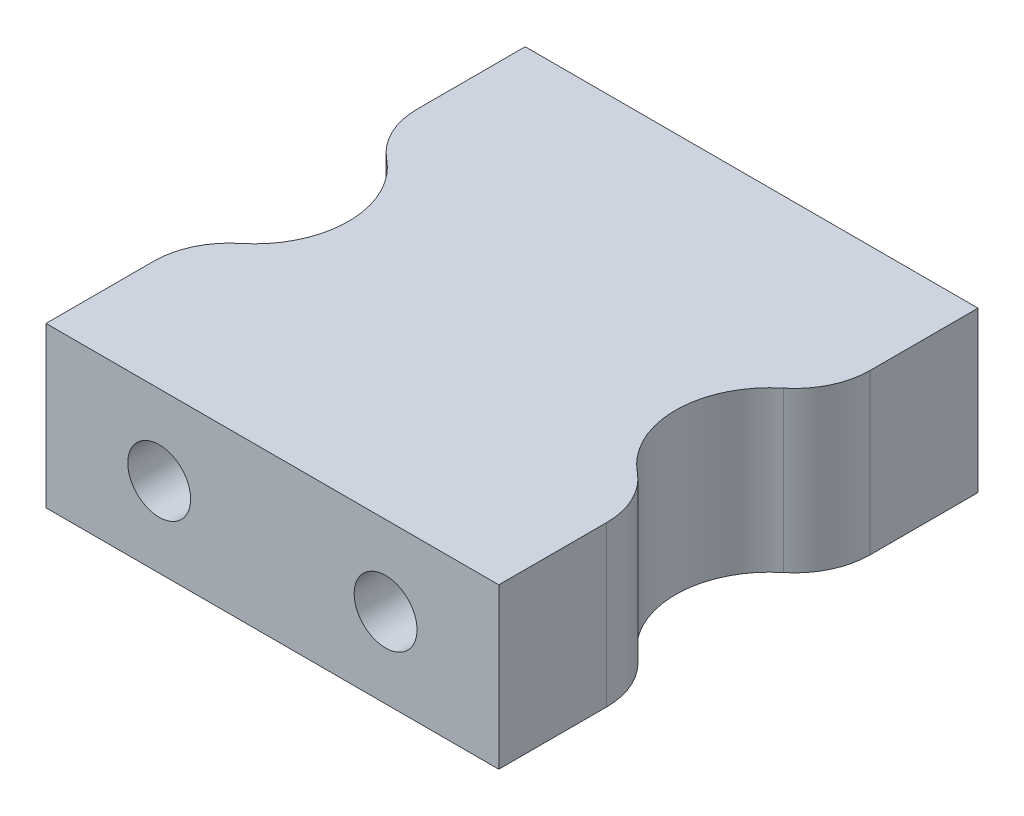
ISO-10303-21;
HEADER;
FILE_DESCRIPTION(('STEP AP214'),'2;1');
FILE_NAME('part.step','',(''),(''),'','','');
FILE_SCHEMA(('AUTOMOTIVE_DESIGN { 1 0 10303 214 1 1 1 1 }'));
ENDSEC;
DATA;
#1=APPLICATION_CONTEXT('core data for automotive mechanical design processes');
#2=APPLICATION_PROTOCOL_DEFINITION('international standard','automotive_design',2000,#1);
#3=PRODUCT_CONTEXT('',#1,'mechanical');
#4=PRODUCT('Part','Part','',(#3));
#5=PRODUCT_RELATED_PRODUCT_CATEGORY('part','',(#4));
#6=PRODUCT_DEFINITION_FORMATION('','',#4);
#7=PRODUCT_DEFINITION_CONTEXT('part definition',#1,'design');
#8=PRODUCT_DEFINITION('design','',#6,#7);
#9=PRODUCT_DEFINITION_SHAPE('','',#8);
#10=(LENGTH_UNIT() NAMED_UNIT(*) SI_UNIT(.MILLI.,.METRE.));
#11=(NAMED_UNIT(*) PLANE_ANGLE_UNIT() SI_UNIT($,.RADIAN.));
#12=(NAMED_UNIT(*) SI_UNIT($,.STERADIAN.) SOLID_ANGLE_UNIT());
#13=UNCERTAINTY_MEASURE_WITH_UNIT(LENGTH_MEASURE(1.E-05),#10,'distance_accuracy_value','');
#14=(GEOMETRIC_REPRESENTATION_CONTEXT(3) GLOBAL_UNCERTAINTY_ASSIGNED_CONTEXT((#13)) GLOBAL_UNIT_ASSIGNED_CONTEXT((#10,
#11,#12)) REPRESENTATION_CONTEXT('',''));
#15=CARTESIAN_POINT('',(0.,0.,0.));
#16=DIRECTION('',(0.,0.,1.));
#17=DIRECTION('',(1.,0.,0.));
#18=AXIS2_PLACEMENT_3D('',#15,#16,#17);
#19=CARTESIAN_POINT('',(0.,0.,19.05));
#20=DIRECTION('',(1.,0.,0.));
#21=DIRECTION('',(0.,1.,0.));
#22=AXIS2_PLACEMENT_3D('',#19,#20,#21);
#23=PLANE('',#22);
#24=DIRECTION('',(0.,0.,-1.));
#25=VECTOR('',#24,1.);
#26=CARTESIAN_POINT('',(0.,0.,19.05));
#27=LINE('',#26,#25);
#28=CARTESIAN_POINT('',(0.,0.,4.28805193839007));
#29=VERTEX_POINT('',#28);
#30=CARTESIAN_POINT('',(0.,0.,0.));
#31=VERTEX_POINT('',#30);
#32=EDGE_CURVE('E161',#29,#31,#27,.T.);
#33=ORIENTED_EDGE('',*,*,#32,.F.);
#34=DIRECTION('',(0.,1.,0.));
#35=VECTOR('',#34,1.);
#36=CARTESIAN_POINT('',(0.,0.,4.28805193839007));
#37=LINE('',#36,#35);
#38=CARTESIAN_POINT('',(0.,6.35,4.28805193839007));
#39=VERTEX_POINT('',#38);
#40=EDGE_CURVE('E11',#29,#39,#37,.T.);
#41=ORIENTED_EDGE('',*,*,#40,.T.);
#42=DIRECTION('',(0.,0.,-1.));
#43=VECTOR('',#42,1.);
#44=CARTESIAN_POINT('',(0.,6.35,19.05));
#45=LINE('',#44,#43);
#46=CARTESIAN_POINT('',(0.,6.35,0.));
#47=VERTEX_POINT('',#46);
#48=EDGE_CURVE('E214',#39,#47,#45,.T.);
#49=ORIENTED_EDGE('',*,*,#48,.T.);
#50=DIRECTION('',(0.,-1.,0.));
#51=VECTOR('',#50,1.);
#52=CARTESIAN_POINT('',(0.,0.,0.));
#53=LINE('',#52,#51);
#54=EDGE_CURVE('E215',#47,#31,#53,.T.);
#55=ORIENTED_EDGE('',*,*,#54,.T.);
#56=EDGE_LOOP('',(#33,#41,#49,#55));
#57=FACE_BOUND('',#56,.T.);
#58=ADVANCED_FACE('F45',(#57),#23,.F.);
#59=CARTESIAN_POINT('',(18.,0.,19.05));
#60=DIRECTION('',(-1.,0.,0.));
#61=DIRECTION('',(0.,0.,1.));
#62=AXIS2_PLACEMENT_3D('',#59,#60,#61);
#63=PLANE('',#62);
#64=DIRECTION('',(0.,0.,-1.));
#65=VECTOR('',#64,1.);
#66=CARTESIAN_POINT('',(18.,0.,19.05));
#67=LINE('',#66,#65);
#68=CARTESIAN_POINT('',(18.,0.,19.05));
#69=VERTEX_POINT('',#68);
#70=CARTESIAN_POINT('',(18.,0.,14.7619480616099));
#71=VERTEX_POINT('',#70);
#72=EDGE_CURVE('E143',#69,#71,#67,.T.);
#73=ORIENTED_EDGE('',*,*,#72,.T.);
#74=DIRECTION('',(0.,1.,0.));
#75=VECTOR('',#74,1.);
#76=CARTESIAN_POINT('',(18.,0.,14.7619480616099));
#77=LINE('',#76,#75);
#78=CARTESIAN_POINT('',(18.,6.35,14.7619480616099));
#79=VERTEX_POINT('',#78);
#80=EDGE_CURVE('E160',#71,#79,#77,.T.);
#81=ORIENTED_EDGE('',*,*,#80,.T.);
#82=DIRECTION('',(0.,0.,-1.));
#83=VECTOR('',#82,1.);
#84=CARTESIAN_POINT('',(18.,6.35,19.05));
#85=LINE('',#84,#83);
#86=CARTESIAN_POINT('',(18.,6.35,19.05));
#87=VERTEX_POINT('',#86);
#88=EDGE_CURVE('E228',#87,#79,#85,.T.);
#89=ORIENTED_EDGE('',*,*,#88,.F.);
#90=DIRECTION('',(0.,1.,0.));
#91=VECTOR('',#90,1.);
#92=CARTESIAN_POINT('',(18.,0.,19.05));
#93=LINE('',#92,#91);
#94=EDGE_CURVE('E146',#69,#87,#93,.T.);
#95=ORIENTED_EDGE('',*,*,#94,.F.);
#96=EDGE_LOOP('',(#73,#81,#89,#95));
#97=FACE_BOUND('',#96,.T.);
#98=ADVANCED_FACE('F253',(#97),#63,.F.);
#99=CARTESIAN_POINT('',(0.,6.35,19.05));
#100=VERTEX_POINT('',#99);
#101=CARTESIAN_POINT('',(0.,6.35,14.7619480616099));
#102=VERTEX_POINT('',#101);
#103=EDGE_CURVE('E226',#100,#102,#45,.T.);
#104=ORIENTED_EDGE('',*,*,#103,.T.);
#105=DIRECTION('',(0.,1.,0.));
#106=VECTOR('',#105,1.);
#107=CARTESIAN_POINT('',(0.,0.,14.7619480616099));
#108=LINE('',#107,#106);
#109=CARTESIAN_POINT('',(0.,0.,14.7619480616099));
#110=VERTEX_POINT('',#109);
#111=EDGE_CURVE('E53',#102,#110,#108,.F.);
#112=ORIENTED_EDGE('',*,*,#111,.T.);
#113=CARTESIAN_POINT('',(0.,0.,19.05));
#114=VERTEX_POINT('',#113);
#115=EDGE_CURVE('E140',#114,#110,#27,.T.);
#116=ORIENTED_EDGE('',*,*,#115,.F.);
#117=DIRECTION('',(0.,-1.,0.));
#118=VECTOR('',#117,1.);
#119=CARTESIAN_POINT('',(0.,0.,19.05));
#120=LINE('',#119,#118);
#121=EDGE_CURVE('E147',#100,#114,#120,.T.);
#122=ORIENTED_EDGE('',*,*,#121,.F.);
#123=EDGE_LOOP('',(#104,#112,#116,#122));
#124=FACE_BOUND('',#123,.T.);
#125=ADVANCED_FACE('F158',(#124),#23,.F.);
#126=CARTESIAN_POINT('',(0.,0.,19.05));
#127=DIRECTION('',(0.,1.,0.));
#128=DIRECTION('',(0.,0.,1.));
#129=AXIS2_PLACEMENT_3D('',#126,#127,#128);
#130=PLANE('',#129);
#131=CARTESIAN_POINT('',(19.235125,0.,9.525));
#132=DIRECTION('',(0.,1.,0.));
#133=DIRECTION('',(1.,0.,0.));
#134=AXIS2_PLACEMENT_3D('',#131,#132,#133);
#135=CIRCLE('',#134,3.735125);
#136=CARTESIAN_POINT('',(16.8864349214009,0.,6.62072493032857));
#137=VERTEX_POINT('',#136);
#138=CARTESIAN_POINT('',(16.8864349214009,0.,12.4292750696714));
#139=VERTEX_POINT('',#138);
#140=EDGE_CURVE('E206',#137,#139,#135,.T.);
#141=ORIENTED_EDGE('',*,*,#140,.T.);
#142=CARTESIAN_POINT('',(15.,0.,14.7619480616099));
#143=DIRECTION('',(0.,1.,0.));
#144=DIRECTION('',(0.,0.,1.));
#145=AXIS2_PLACEMENT_3D('',#142,#143,#144);
#146=CIRCLE('',#145,3.);
#147=EDGE_CURVE('E186',#139,#71,#146,.F.);
#148=ORIENTED_EDGE('',*,*,#147,.T.);
#149=ORIENTED_EDGE('',*,*,#72,.F.);
#150=DIRECTION('',(1.,0.,0.));
#151=VECTOR('',#150,1.);
#152=CARTESIAN_POINT('',(0.,0.,19.05));
#153=LINE('',#152,#151);
#154=EDGE_CURVE('E135',#114,#69,#153,.T.);
#155=ORIENTED_EDGE('',*,*,#154,.F.);
#156=ORIENTED_EDGE('',*,*,#115,.T.);
#157=CARTESIAN_POINT('',(3.,0.,14.7619480616099));
#158=DIRECTION('',(0.,1.,0.));
#159=DIRECTION('',(0.,0.,1.));
#160=AXIS2_PLACEMENT_3D('',#157,#158,#159);
#161=CIRCLE('',#160,3.);
#162=CARTESIAN_POINT('',(1.11356507859914,0.,12.4292750696714));
#163=VERTEX_POINT('',#162);
#164=EDGE_CURVE('E182',#110,#163,#161,.F.);
#165=ORIENTED_EDGE('',*,*,#164,.T.);
#166=CARTESIAN_POINT('',(-1.235125,0.,9.525));
#167=DIRECTION('',(0.,1.,0.));
#168=DIRECTION('',(-1.,0.,0.));
#169=AXIS2_PLACEMENT_3D('',#166,#167,#168);
#170=CIRCLE('',#169,3.735125);
#171=CARTESIAN_POINT('',(1.11356507859914,0.,6.62072493032857));
#172=VERTEX_POINT('',#171);
#173=EDGE_CURVE('E197',#163,#172,#170,.T.);
#174=ORIENTED_EDGE('',*,*,#173,.T.);
#175=CARTESIAN_POINT('',(3.,0.,4.28805193839007));
#176=DIRECTION('',(0.,1.,0.));
#177=DIRECTION('',(0.,0.,1.));
#178=AXIS2_PLACEMENT_3D('',#175,#176,#177);
#179=CIRCLE('',#178,3.);
#180=EDGE_CURVE('E60',#172,#29,#179,.F.);
#181=ORIENTED_EDGE('',*,*,#180,.T.);
#182=ORIENTED_EDGE('',*,*,#32,.T.);
#183=DIRECTION('',(1.,0.,0.));
#184=VECTOR('',#183,1.);
#185=CARTESIAN_POINT('',(0.,0.,0.));
#186=LINE('',#185,#184);
#187=CARTESIAN_POINT('',(18.,0.,0.));
#188=VERTEX_POINT('',#187);
#189=EDGE_CURVE('E218',#31,#188,#186,.T.);
#190=ORIENTED_EDGE('',*,*,#189,.T.);
#191=CARTESIAN_POINT('',(18.,0.,4.28805193839007));
#192=VERTEX_POINT('',#191);
#193=EDGE_CURVE('E229',#192,#188,#67,.T.);
#194=ORIENTED_EDGE('',*,*,#193,.F.);
#195=CARTESIAN_POINT('',(15.,0.,4.28805193839007));
#196=DIRECTION('',(0.,1.,0.));
#197=DIRECTION('',(0.,0.,1.));
#198=AXIS2_PLACEMENT_3D('',#195,#196,#197);
#199=CIRCLE('',#198,3.);
#200=EDGE_CURVE('E184',#192,#137,#199,.F.);
#201=ORIENTED_EDGE('',*,*,#200,.T.);
#202=EDGE_LOOP('',(#141,#148,#149,#155,#156,#165,#174,#181,#182,#190,#194,#201));
#203=FACE_BOUND('',#202,.T.);
#204=ADVANCED_FACE('F138',(#203),#130,.F.);
#205=CARTESIAN_POINT('',(18.,6.35,4.28805193839007));
#206=VERTEX_POINT('',#205);
#207=CARTESIAN_POINT('',(18.,6.35,0.));
#208=VERTEX_POINT('',#207);
#209=EDGE_CURVE('E227',#206,#208,#85,.T.);
#210=ORIENTED_EDGE('',*,*,#209,.F.);
#211=DIRECTION('',(0.,1.,0.));
#212=VECTOR('',#211,1.);
#213=CARTESIAN_POINT('',(18.,0.,4.28805193839007));
#214=LINE('',#213,#212);
#215=EDGE_CURVE('E188',#206,#192,#214,.F.);
#216=ORIENTED_EDGE('',*,*,#215,.T.);
#217=ORIENTED_EDGE('',*,*,#193,.T.);
#218=DIRECTION('',(0.,1.,0.));
#219=VECTOR('',#218,1.);
#220=CARTESIAN_POINT('',(18.,0.,0.));
#221=LINE('',#220,#219);
#222=EDGE_CURVE('E221',#188,#208,#221,.T.);
#223=ORIENTED_EDGE('',*,*,#222,.T.);
#224=EDGE_LOOP('',(#210,#216,#217,#223));
#225=FACE_BOUND('',#224,.T.);
#226=ADVANCED_FACE('F238',(#225),#63,.F.);
#227=CARTESIAN_POINT('',(0.,6.35,19.05));
#228=DIRECTION('',(0.,-1.,0.));
#229=DIRECTION('',(0.,0.,-1.));
#230=AXIS2_PLACEMENT_3D('',#227,#228,#229);
#231=PLANE('',#230);
#232=ORIENTED_EDGE('',*,*,#88,.T.);
#233=CARTESIAN_POINT('',(15.,6.35,14.7619480616099));
#234=DIRECTION('',(0.,-1.,0.));
#235=DIRECTION('',(0.,0.,-1.));
#236=AXIS2_PLACEMENT_3D('',#233,#234,#235);
#237=CIRCLE('',#236,3.);
#238=CARTESIAN_POINT('',(16.8864349214009,6.35,12.4292750696714));
#239=VERTEX_POINT('',#238);
#240=EDGE_CURVE('E174',#79,#239,#237,.F.);
#241=ORIENTED_EDGE('',*,*,#240,.T.);
#242=CARTESIAN_POINT('',(19.235125,6.35,9.525));
#243=DIRECTION('',(0.,1.,0.));
#244=DIRECTION('',(1.,0.,0.));
#245=AXIS2_PLACEMENT_3D('',#242,#243,#244);
#246=CIRCLE('',#245,3.735125);
#247=CARTESIAN_POINT('',(16.8864349214009,6.35,6.62072493032857));
#248=VERTEX_POINT('',#247);
#249=EDGE_CURVE('E203',#248,#239,#246,.T.);
#250=ORIENTED_EDGE('',*,*,#249,.F.);
#251=CARTESIAN_POINT('',(15.,6.35,4.28805193839007));
#252=DIRECTION('',(0.,-1.,0.));
#253=DIRECTION('',(0.,0.,-1.));
#254=AXIS2_PLACEMENT_3D('',#251,#252,#253);
#255=CIRCLE('',#254,3.);
#256=EDGE_CURVE('E172',#248,#206,#255,.F.);
#257=ORIENTED_EDGE('',*,*,#256,.T.);
#258=ORIENTED_EDGE('',*,*,#209,.T.);
#259=DIRECTION('',(-1.,0.,0.));
#260=VECTOR('',#259,1.);
#261=CARTESIAN_POINT('',(0.,6.35,0.));
#262=LINE('',#261,#260);
#263=EDGE_CURVE('E156',#208,#47,#262,.T.);
#264=ORIENTED_EDGE('',*,*,#263,.T.);
#265=ORIENTED_EDGE('',*,*,#48,.F.);
#266=CARTESIAN_POINT('',(3.,6.35,4.28805193839007));
#267=DIRECTION('',(0.,-1.,0.));
#268=DIRECTION('',(0.,0.,-1.));
#269=AXIS2_PLACEMENT_3D('',#266,#267,#268);
#270=CIRCLE('',#269,3.);
#271=CARTESIAN_POINT('',(1.11356507859914,6.35,6.62072493032857));
#272=VERTEX_POINT('',#271);
#273=EDGE_CURVE('E164',#39,#272,#270,.F.);
#274=ORIENTED_EDGE('',*,*,#273,.T.);
#275=CARTESIAN_POINT('',(-1.235125,6.35,9.525));
#276=DIRECTION('',(0.,1.,0.));
#277=DIRECTION('',(-1.,0.,0.));
#278=AXIS2_PLACEMENT_3D('',#275,#276,#277);
#279=CIRCLE('',#278,3.735125);
#280=CARTESIAN_POINT('',(1.11356507859914,6.35,12.4292750696714));
#281=VERTEX_POINT('',#280);
#282=EDGE_CURVE('E196',#281,#272,#279,.T.);
#283=ORIENTED_EDGE('',*,*,#282,.F.);
#284=CARTESIAN_POINT('',(3.,6.35,14.7619480616099));
#285=DIRECTION('',(0.,-1.,0.));
#286=DIRECTION('',(0.,0.,-1.));
#287=AXIS2_PLACEMENT_3D('',#284,#285,#286);
#288=CIRCLE('',#287,3.);
#289=EDGE_CURVE('E170',#281,#102,#288,.F.);
#290=ORIENTED_EDGE('',*,*,#289,.T.);
#291=ORIENTED_EDGE('',*,*,#103,.F.);
#292=DIRECTION('',(-1.,0.,0.));
#293=VECTOR('',#292,1.);
#294=CARTESIAN_POINT('',(0.,6.35,19.05));
#295=LINE('',#294,#293);
#296=EDGE_CURVE('E152',#87,#100,#295,.T.);
#297=ORIENTED_EDGE('',*,*,#296,.F.);
#298=EDGE_LOOP('',(#232,#241,#250,#257,#258,#264,#265,#274,#283,#290,#291,#297));
#299=FACE_BOUND('',#298,.T.);
#300=ADVANCED_FACE('F201',(#299),#231,.F.);
#301=CARTESIAN_POINT('',(0.,0.,19.05));
#302=DIRECTION('',(0.,0.,-1.));
#303=DIRECTION('',(-1.,0.,0.));
#304=AXIS2_PLACEMENT_3D('',#301,#302,#303);
#305=PLANE('',#304);
#306=CARTESIAN_POINT('',(13.5,3.175,19.05));
#307=DIRECTION('',(0.,0.,-1.));
#308=DIRECTION('',(-1.,0.,0.));
#309=AXIS2_PLACEMENT_3D('',#306,#307,#308);
#310=CIRCLE('',#309,1.25);
#311=CARTESIAN_POINT('',(12.25,3.175,19.05));
#312=VERTEX_POINT('',#311);
#313=EDGE_CURVE('E325',#312,#312,#310,.T.);
#314=ORIENTED_EDGE('',*,*,#313,.T.);
#315=EDGE_LOOP('',(#314));
#316=FACE_BOUND('',#315,.T.);
#317=CARTESIAN_POINT('',(4.5,3.175,19.05));
#318=DIRECTION('',(0.,0.,-1.));
#319=DIRECTION('',(-1.,0.,0.));
#320=AXIS2_PLACEMENT_3D('',#317,#318,#319);
#321=CIRCLE('',#320,1.25);
#322=CARTESIAN_POINT('',(3.25,3.175,19.05));
#323=VERTEX_POINT('',#322);
#324=EDGE_CURVE('E336',#323,#323,#321,.T.);
#325=ORIENTED_EDGE('',*,*,#324,.T.);
#326=EDGE_LOOP('',(#325));
#327=FACE_BOUND('',#326,.T.);
#328=ORIENTED_EDGE('',*,*,#121,.T.);
#329=ORIENTED_EDGE('',*,*,#154,.T.);
#330=ORIENTED_EDGE('',*,*,#94,.T.);
#331=ORIENTED_EDGE('',*,*,#296,.T.);
#332=EDGE_LOOP('',(#328,#329,#330,#331));
#333=FACE_BOUND('',#332,.T.);
#334=ADVANCED_FACE('F150',(#316,#327,#333),#305,.F.);
#335=CARTESIAN_POINT('',(0.,0.,0.));
#336=DIRECTION('',(0.,0.,-1.));
#337=DIRECTION('',(-1.,0.,0.));
#338=AXIS2_PLACEMENT_3D('',#335,#336,#337);
#339=PLANE('',#338);
#340=CARTESIAN_POINT('',(13.5,3.175,0.));
#341=DIRECTION('',(0.,0.,-1.));
#342=DIRECTION('',(-1.,0.,0.));
#343=AXIS2_PLACEMENT_3D('',#340,#341,#342);
#344=CIRCLE('',#343,1.25);
#345=CARTESIAN_POINT('',(12.25,3.175,0.));
#346=VERTEX_POINT('',#345);
#347=EDGE_CURVE('E341',#346,#346,#344,.T.);
#348=ORIENTED_EDGE('',*,*,#347,.F.);
#349=EDGE_LOOP('',(#348));
#350=FACE_BOUND('',#349,.T.);
#351=CARTESIAN_POINT('',(4.5,3.175,0.));
#352=DIRECTION('',(0.,0.,-1.));
#353=DIRECTION('',(-1.,0.,0.));
#354=AXIS2_PLACEMENT_3D('',#351,#352,#353);
#355=CIRCLE('',#354,1.25);
#356=CARTESIAN_POINT('',(3.25,3.175,0.));
#357=VERTEX_POINT('',#356);
#358=EDGE_CURVE('E328',#357,#357,#355,.T.);
#359=ORIENTED_EDGE('',*,*,#358,.F.);
#360=EDGE_LOOP('',(#359));
#361=FACE_BOUND('',#360,.T.);
#362=ORIENTED_EDGE('',*,*,#54,.F.);
#363=ORIENTED_EDGE('',*,*,#263,.F.);
#364=ORIENTED_EDGE('',*,*,#222,.F.);
#365=ORIENTED_EDGE('',*,*,#189,.F.);
#366=EDGE_LOOP('',(#362,#363,#364,#365));
#367=FACE_BOUND('',#366,.T.);
#368=ADVANCED_FACE('F242',(#350,#361,#367),#339,.T.);
#369=CARTESIAN_POINT('',(-1.235125,0.,9.525));
#370=DIRECTION('',(0.,1.,0.));
#371=DIRECTION('',(-1.,0.,0.));
#372=AXIS2_PLACEMENT_3D('',#369,#370,#371);
#373=CYLINDRICAL_SURFACE('',#372,3.735125);
#374=ORIENTED_EDGE('',*,*,#173,.F.);
#375=DIRECTION('',(0.,1.,0.));
#376=VECTOR('',#375,1.);
#377=CARTESIAN_POINT('',(1.11356507859914,0.,12.4292750696714));
#378=LINE('',#377,#376);
#379=EDGE_CURVE('E191',#163,#281,#378,.T.);
#380=ORIENTED_EDGE('',*,*,#379,.T.);
#381=ORIENTED_EDGE('',*,*,#282,.T.);
#382=DIRECTION('',(0.,1.,0.));
#383=VECTOR('',#382,1.);
#384=CARTESIAN_POINT('',(1.11356507859914,0.,6.62072493032857));
#385=LINE('',#384,#383);
#386=EDGE_CURVE('E68',#272,#172,#385,.F.);
#387=ORIENTED_EDGE('',*,*,#386,.T.);
#388=EDGE_LOOP('',(#374,#380,#381,#387));
#389=FACE_BOUND('',#388,.T.);
#390=ADVANCED_FACE('F195',(#389),#373,.F.);
#391=CARTESIAN_POINT('',(19.235125,0.,9.525));
#392=DIRECTION('',(0.,1.,0.));
#393=DIRECTION('',(-1.,0.,0.));
#394=AXIS2_PLACEMENT_3D('',#391,#392,#393);
#395=CYLINDRICAL_SURFACE('',#394,3.735125);
#396=ORIENTED_EDGE('',*,*,#249,.T.);
#397=DIRECTION('',(0.,1.,0.));
#398=VECTOR('',#397,1.);
#399=CARTESIAN_POINT('',(16.8864349214009,0.,12.4292750696714));
#400=LINE('',#399,#398);
#401=EDGE_CURVE('E179',#239,#139,#400,.F.);
#402=ORIENTED_EDGE('',*,*,#401,.T.);
#403=ORIENTED_EDGE('',*,*,#140,.F.);
#404=DIRECTION('',(0.,1.,0.));
#405=VECTOR('',#404,1.);
#406=CARTESIAN_POINT('',(16.8864349214009,0.,6.62072493032857));
#407=LINE('',#406,#405);
#408=EDGE_CURVE('E176',#137,#248,#407,.T.);
#409=ORIENTED_EDGE('',*,*,#408,.T.);
#410=EDGE_LOOP('',(#396,#402,#403,#409));
#411=FACE_BOUND('',#410,.T.);
#412=ADVANCED_FACE('F281',(#411),#395,.F.);
#413=CARTESIAN_POINT('',(4.5,3.175,5.));
#414=DIRECTION('',(0.,0.,-1.));
#415=DIRECTION('',(-1.,0.,0.));
#416=AXIS2_PLACEMENT_3D('',#413,#414,#415);
#417=CYLINDRICAL_SURFACE('',#416,1.25);
#418=CARTESIAN_POINT('',(4.5,3.175,5.));
#419=DIRECTION('',(0.,0.,-1.));
#420=DIRECTION('',(-1.,0.,0.));
#421=AXIS2_PLACEMENT_3D('',#418,#419,#420);
#422=CIRCLE('',#421,1.25);
#423=CARTESIAN_POINT('',(3.25,3.175,5.));
#424=VERTEX_POINT('',#423);
#425=EDGE_CURVE('E324',#424,#424,#422,.T.);
#426=ORIENTED_EDGE('',*,*,#425,.F.);
#427=EDGE_LOOP('',(#426));
#428=FACE_BOUND('',#427,.T.);
#429=ORIENTED_EDGE('',*,*,#358,.T.);
#430=EDGE_LOOP('',(#429));
#431=FACE_BOUND('',#430,.T.);
#432=ADVANCED_FACE('F284',(#428,#431),#417,.F.);
#433=CARTESIAN_POINT('',(4.5,3.175,5.));
#434=DIRECTION('',(0.,0.,-1.));
#435=DIRECTION('',(-1.,0.,0.));
#436=AXIS2_PLACEMENT_3D('',#433,#434,#435);
#437=PLANE('',#436);
#438=ORIENTED_EDGE('',*,*,#425,.T.);
#439=EDGE_LOOP('',(#438));
#440=FACE_BOUND('',#439,.T.);
#441=ADVANCED_FACE('F286',(#440),#437,.T.);
#442=CARTESIAN_POINT('',(13.5,3.175,5.));
#443=DIRECTION('',(0.,0.,-1.));
#444=DIRECTION('',(-1.,0.,0.));
#445=AXIS2_PLACEMENT_3D('',#442,#443,#444);
#446=CYLINDRICAL_SURFACE('',#445,1.25);
#447=CARTESIAN_POINT('',(13.5,3.175,5.));
#448=DIRECTION('',(0.,0.,-1.));
#449=DIRECTION('',(-1.,0.,0.));
#450=AXIS2_PLACEMENT_3D('',#447,#448,#449);
#451=CIRCLE('',#450,1.25);
#452=CARTESIAN_POINT('',(12.25,3.175,5.));
#453=VERTEX_POINT('',#452);
#454=EDGE_CURVE('E208',#453,#453,#451,.T.);
#455=ORIENTED_EDGE('',*,*,#454,.F.);
#456=EDGE_LOOP('',(#455));
#457=FACE_BOUND('',#456,.T.);
#458=ORIENTED_EDGE('',*,*,#347,.T.);
#459=EDGE_LOOP('',(#458));
#460=FACE_BOUND('',#459,.T.);
#461=ADVANCED_FACE('F289',(#457,#460),#446,.F.);
#462=CARTESIAN_POINT('',(13.5,3.175,5.));
#463=DIRECTION('',(0.,0.,-1.));
#464=DIRECTION('',(-1.,0.,0.));
#465=AXIS2_PLACEMENT_3D('',#462,#463,#464);
#466=PLANE('',#465);
#467=ORIENTED_EDGE('',*,*,#454,.T.);
#468=EDGE_LOOP('',(#467));
#469=FACE_BOUND('',#468,.T.);
#470=ADVANCED_FACE('F296',(#469),#466,.T.);
#471=CARTESIAN_POINT('',(4.5,3.175,14.05));
#472=DIRECTION('',(0.,0.,1.));
#473=DIRECTION('',(1.,0.,0.));
#474=AXIS2_PLACEMENT_3D('',#471,#472,#473);
#475=CYLINDRICAL_SURFACE('',#474,1.25);
#476=CARTESIAN_POINT('',(4.5,3.175,14.05));
#477=DIRECTION('',(0.,0.,-1.));
#478=DIRECTION('',(-1.,0.,0.));
#479=AXIS2_PLACEMENT_3D('',#476,#477,#478);
#480=CIRCLE('',#479,1.25);
#481=CARTESIAN_POINT('',(3.25,3.175,14.05));
#482=VERTEX_POINT('',#481);
#483=EDGE_CURVE('E331',#482,#482,#480,.T.);
#484=ORIENTED_EDGE('',*,*,#483,.T.);
#485=EDGE_LOOP('',(#484));
#486=FACE_BOUND('',#485,.T.);
#487=ORIENTED_EDGE('',*,*,#324,.F.);
#488=EDGE_LOOP('',(#487));
#489=FACE_BOUND('',#488,.T.);
#490=ADVANCED_FACE('F300',(#486,#489),#475,.F.);
#491=CARTESIAN_POINT('',(4.5,3.175,14.05));
#492=DIRECTION('',(0.,0.,1.));
#493=DIRECTION('',(-1.,0.,0.));
#494=AXIS2_PLACEMENT_3D('',#491,#492,#493);
#495=PLANE('',#494);
#496=ORIENTED_EDGE('',*,*,#483,.F.);
#497=EDGE_LOOP('',(#496));
#498=FACE_BOUND('',#497,.T.);
#499=ADVANCED_FACE('F304',(#498),#495,.T.);
#500=CARTESIAN_POINT('',(13.5,3.175,14.05));
#501=DIRECTION('',(0.,0.,1.));
#502=DIRECTION('',(1.,0.,0.));
#503=AXIS2_PLACEMENT_3D('',#500,#501,#502);
#504=CYLINDRICAL_SURFACE('',#503,1.25);
#505=CARTESIAN_POINT('',(13.5,3.175,14.05));
#506=DIRECTION('',(0.,0.,-1.));
#507=DIRECTION('',(-1.,0.,0.));
#508=AXIS2_PLACEMENT_3D('',#505,#506,#507);
#509=CIRCLE('',#508,1.25);
#510=CARTESIAN_POINT('',(12.25,3.175,14.05));
#511=VERTEX_POINT('',#510);
#512=EDGE_CURVE('E323',#511,#511,#509,.T.);
#513=ORIENTED_EDGE('',*,*,#512,.T.);
#514=EDGE_LOOP('',(#513));
#515=FACE_BOUND('',#514,.T.);
#516=ORIENTED_EDGE('',*,*,#313,.F.);
#517=EDGE_LOOP('',(#516));
#518=FACE_BOUND('',#517,.T.);
#519=ADVANCED_FACE('F308',(#515,#518),#504,.F.);
#520=CARTESIAN_POINT('',(13.5,3.175,14.05));
#521=DIRECTION('',(0.,0.,1.));
#522=DIRECTION('',(-1.,0.,0.));
#523=AXIS2_PLACEMENT_3D('',#520,#521,#522);
#524=PLANE('',#523);
#525=ORIENTED_EDGE('',*,*,#512,.F.);
#526=EDGE_LOOP('',(#525));
#527=FACE_BOUND('',#526,.T.);
#528=ADVANCED_FACE('F312',(#527),#524,.T.);
#529=CARTESIAN_POINT('',(15.,0.,14.7619480616099));
#530=DIRECTION('',(0.,1.,0.));
#531=DIRECTION('',(-1.,0.,0.));
#532=AXIS2_PLACEMENT_3D('',#529,#530,#531);
#533=CYLINDRICAL_SURFACE('',#532,3.);
#534=ORIENTED_EDGE('',*,*,#147,.F.);
#535=ORIENTED_EDGE('',*,*,#401,.F.);
#536=ORIENTED_EDGE('',*,*,#240,.F.);
#537=ORIENTED_EDGE('',*,*,#80,.F.);
#538=EDGE_LOOP('',(#534,#535,#536,#537));
#539=FACE_BOUND('',#538,.T.);
#540=ADVANCED_FACE('F315',(#539),#533,.T.);
#541=CARTESIAN_POINT('',(15.,0.,4.28805193839007));
#542=DIRECTION('',(0.,1.,0.));
#543=DIRECTION('',(-1.,0.,0.));
#544=AXIS2_PLACEMENT_3D('',#541,#542,#543);
#545=CYLINDRICAL_SURFACE('',#544,3.);
#546=ORIENTED_EDGE('',*,*,#200,.F.);
#547=ORIENTED_EDGE('',*,*,#215,.F.);
#548=ORIENTED_EDGE('',*,*,#256,.F.);
#549=ORIENTED_EDGE('',*,*,#408,.F.);
#550=EDGE_LOOP('',(#546,#547,#548,#549));
#551=FACE_BOUND('',#550,.T.);
#552=ADVANCED_FACE('F251',(#551),#545,.T.);
#553=CARTESIAN_POINT('',(3.,0.,14.7619480616099));
#554=DIRECTION('',(0.,1.,0.));
#555=DIRECTION('',(-1.,0.,0.));
#556=AXIS2_PLACEMENT_3D('',#553,#554,#555);
#557=CYLINDRICAL_SURFACE('',#556,3.);
#558=ORIENTED_EDGE('',*,*,#164,.F.);
#559=ORIENTED_EDGE('',*,*,#111,.F.);
#560=ORIENTED_EDGE('',*,*,#289,.F.);
#561=ORIENTED_EDGE('',*,*,#379,.F.);
#562=EDGE_LOOP('',(#558,#559,#560,#561));
#563=FACE_BOUND('',#562,.T.);
#564=ADVANCED_FACE('F247',(#563),#557,.T.);
#565=CARTESIAN_POINT('',(3.,0.,4.28805193839007));
#566=DIRECTION('',(0.,1.,0.));
#567=DIRECTION('',(-1.,0.,0.));
#568=AXIS2_PLACEMENT_3D('',#565,#566,#567);
#569=CYLINDRICAL_SURFACE('',#568,3.);
#570=ORIENTED_EDGE('',*,*,#180,.F.);
#571=ORIENTED_EDGE('',*,*,#386,.F.);
#572=ORIENTED_EDGE('',*,*,#273,.F.);
#573=ORIENTED_EDGE('',*,*,#40,.F.);
#574=EDGE_LOOP('',(#570,#571,#572,#573));
#575=FACE_BOUND('',#574,.T.);
#576=ADVANCED_FACE('F47',(#575),#569,.T.);
#577=CLOSED_SHELL('',(#58,#98,#125,#204,#226,#300,#334,#368,#390,#412,#432,#441,#461,#470,#490,
#499,#519,#528,#540,#552,#564,#576));
#578=MANIFOLD_SOLID_BREP('B2',#577);
#579=ADVANCED_BREP_SHAPE_REPRESENTATION('',(#18,#578),#14);
#580=SHAPE_DEFINITION_REPRESENTATION(#9,#579);
ENDSEC;
END-ISO-10303-21;
